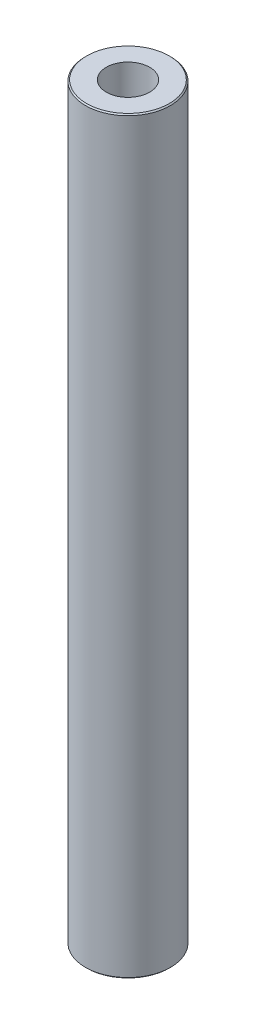
ISO-10303-21;
HEADER;
FILE_DESCRIPTION(('STEP AP214'),'2;1');
FILE_NAME('part.step','',(''),(''),'','','');
FILE_SCHEMA(('AUTOMOTIVE_DESIGN { 1 0 10303 214 1 1 1 1 }'));
ENDSEC;
DATA;
#1=APPLICATION_CONTEXT('core data for automotive mechanical design processes');
#2=APPLICATION_PROTOCOL_DEFINITION('international standard','automotive_design',2000,#1);
#3=PRODUCT_CONTEXT('',#1,'mechanical');
#4=PRODUCT('Part','Part','',(#3));
#5=PRODUCT_RELATED_PRODUCT_CATEGORY('part','',(#4));
#6=PRODUCT_DEFINITION_FORMATION('','',#4);
#7=PRODUCT_DEFINITION_CONTEXT('part definition',#1,'design');
#8=PRODUCT_DEFINITION('design','',#6,#7);
#9=PRODUCT_DEFINITION_SHAPE('','',#8);
#10=(LENGTH_UNIT() NAMED_UNIT(*) SI_UNIT(.MILLI.,.METRE.));
#11=(NAMED_UNIT(*) PLANE_ANGLE_UNIT() SI_UNIT($,.RADIAN.));
#12=(NAMED_UNIT(*) SI_UNIT($,.STERADIAN.) SOLID_ANGLE_UNIT());
#13=UNCERTAINTY_MEASURE_WITH_UNIT(LENGTH_MEASURE(1.E-05),#10,'distance_accuracy_value','');
#14=(GEOMETRIC_REPRESENTATION_CONTEXT(3) GLOBAL_UNCERTAINTY_ASSIGNED_CONTEXT((#13)) GLOBAL_UNIT_ASSIGNED_CONTEXT((#10,
#11,#12)) REPRESENTATION_CONTEXT('',''));
#15=CARTESIAN_POINT('',(0.,0.,0.));
#16=DIRECTION('',(0.,0.,1.));
#17=DIRECTION('',(1.,0.,0.));
#18=AXIS2_PLACEMENT_3D('',#15,#16,#17);
#19=CARTESIAN_POINT('',(0.,176.232016984306,0.));
#20=DIRECTION('',(0.,-1.,0.));
#21=DIRECTION('',(0.,0.,-1.));
#22=AXIS2_PLACEMENT_3D('',#19,#20,#21);
#23=CYLINDRICAL_SURFACE('',#22,10.);
#24=CARTESIAN_POINT('',(0.,175.955005369372,0.));
#25=DIRECTION('',(0.,1.,0.));
#26=DIRECTION('',(0.,0.,1.));
#27=AXIS2_PLACEMENT_3D('',#24,#25,#26);
#28=CIRCLE('',#27,10.);
#29=CARTESIAN_POINT('',(0.,175.955005369372,10.));
#30=VERTEX_POINT('',#29);
#31=EDGE_CURVE('E50',#30,#30,#28,.F.);
#32=ORIENTED_EDGE('',*,*,#31,.T.);
#33=EDGE_LOOP('',(#32));
#34=FACE_BOUND('',#33,.T.);
#35=CARTESIAN_POINT('',(0.,0.280000242436906,0.));
#36=DIRECTION('',(0.,1.,0.));
#37=DIRECTION('',(0.,0.,1.));
#38=AXIS2_PLACEMENT_3D('',#35,#36,#37);
#39=CIRCLE('',#38,10.);
#40=CARTESIAN_POINT('',(0.,0.280000242436906,10.));
#41=VERTEX_POINT('',#40);
#42=EDGE_CURVE('E51',#41,#41,#39,.T.);
#43=ORIENTED_EDGE('',*,*,#42,.T.);
#44=EDGE_LOOP('',(#43));
#45=FACE_BOUND('',#44,.T.);
#46=ADVANCED_FACE('F39',(#34,#45),#23,.T.);
#47=CARTESIAN_POINT('',(0.,176.232016984306,0.));
#48=DIRECTION('',(0.,1.,0.));
#49=DIRECTION('',(0.,0.,1.));
#50=AXIS2_PLACEMENT_3D('',#47,#48,#49);
#51=PLANE('',#50);
#52=CARTESIAN_POINT('',(0.,176.232016984306,0.));
#53=DIRECTION('',(0.,1.,0.));
#54=DIRECTION('',(0.,0.,1.));
#55=AXIS2_PLACEMENT_3D('',#52,#53,#54);
#56=CIRCLE('',#55,9.7199997575631);
#57=CARTESIAN_POINT('',(0.,176.232016984306,9.7199997575631));
#58=VERTEX_POINT('',#57);
#59=EDGE_CURVE('E54',#58,#58,#56,.T.);
#60=ORIENTED_EDGE('',*,*,#59,.T.);
#61=EDGE_LOOP('',(#60));
#62=FACE_BOUND('',#61,.T.);
#63=CARTESIAN_POINT('',(0.,176.232016984306,0.));
#64=DIRECTION('',(0.,1.,0.));
#65=DIRECTION('',(0.,0.,1.));
#66=AXIS2_PLACEMENT_3D('',#63,#64,#65);
#67=CIRCLE('',#66,5.09998180592396);
#68=CARTESIAN_POINT('',(0.,176.232016984306,5.09998180592396));
#69=VERTEX_POINT('',#68);
#70=EDGE_CURVE('E58',#69,#69,#67,.T.);
#71=ORIENTED_EDGE('',*,*,#70,.F.);
#72=EDGE_LOOP('',(#71));
#73=FACE_BOUND('',#72,.T.);
#74=ADVANCED_FACE('F69',(#62,#73),#51,.T.);
#75=CARTESIAN_POINT('',(0.,0.,0.));
#76=DIRECTION('',(0.,1.,0.));
#77=DIRECTION('',(0.,0.,1.));
#78=AXIS2_PLACEMENT_3D('',#75,#76,#77);
#79=PLANE('',#78);
#80=CARTESIAN_POINT('',(0.,0.,0.));
#81=DIRECTION('',(0.,1.,0.));
#82=DIRECTION('',(0.,0.,1.));
#83=AXIS2_PLACEMENT_3D('',#80,#81,#82);
#84=CIRCLE('',#83,9.72298838506532);
#85=CARTESIAN_POINT('',(0.,0.,9.72298838506532));
#86=VERTEX_POINT('',#85);
#87=EDGE_CURVE('E10',#86,#86,#84,.F.);
#88=ORIENTED_EDGE('',*,*,#87,.T.);
#89=EDGE_LOOP('',(#88));
#90=FACE_BOUND('',#89,.T.);
#91=CARTESIAN_POINT('',(0.,0.,0.));
#92=DIRECTION('',(0.,1.,0.));
#93=DIRECTION('',(0.,0.,1.));
#94=AXIS2_PLACEMENT_3D('',#91,#92,#93);
#95=CIRCLE('',#94,5.09998180592396);
#96=CARTESIAN_POINT('',(0.,0.,5.09998180592396));
#97=VERTEX_POINT('',#96);
#98=EDGE_CURVE('E63',#97,#97,#95,.T.);
#99=ORIENTED_EDGE('',*,*,#98,.T.);
#100=EDGE_LOOP('',(#99));
#101=FACE_BOUND('',#100,.T.);
#102=ADVANCED_FACE('F75',(#90,#101),#79,.F.);
#103=CARTESIAN_POINT('',(0.,176.232016984306,0.));
#104=DIRECTION('',(0.,-1.,0.));
#105=DIRECTION('',(0.,0.,-1.));
#106=AXIS2_PLACEMENT_3D('',#103,#104,#105);
#107=CYLINDRICAL_SURFACE('',#106,5.09998180592396);
#108=ORIENTED_EDGE('',*,*,#70,.T.);
#109=EDGE_LOOP('',(#108));
#110=FACE_BOUND('',#109,.T.);
#111=ORIENTED_EDGE('',*,*,#98,.F.);
#112=EDGE_LOOP('',(#111));
#113=FACE_BOUND('',#112,.T.);
#114=ADVANCED_FACE('F70',(#110,#113),#107,.F.);
#115=CARTESIAN_POINT('',(0.,176.232016984306,0.));
#116=DIRECTION('',(0.,-1.,0.));
#117=DIRECTION('',(0.,0.,-1.));
#118=AXIS2_PLACEMENT_3D('',#115,#116,#117);
#119=CONICAL_SURFACE('',#118,9.7199997575631,0.790763576690017);
#120=ORIENTED_EDGE('',*,*,#31,.F.);
#121=EDGE_LOOP('',(#120));
#122=FACE_BOUND('',#121,.T.);
#123=ORIENTED_EDGE('',*,*,#59,.F.);
#124=EDGE_LOOP('',(#123));
#125=FACE_BOUND('',#124,.T.);
#126=ADVANCED_FACE('F81',(#122,#125),#119,.T.);
#127=CARTESIAN_POINT('',(0.,0.280000242436906,0.));
#128=DIRECTION('',(0.,1.,0.));
#129=DIRECTION('',(0.,0.,1.));
#130=AXIS2_PLACEMENT_3D('',#127,#128,#129);
#131=CONICAL_SURFACE('',#130,10.,0.780032750104924);
#132=ORIENTED_EDGE('',*,*,#87,.F.);
#133=EDGE_LOOP('',(#132));
#134=FACE_BOUND('',#133,.T.);
#135=ORIENTED_EDGE('',*,*,#42,.F.);
#136=EDGE_LOOP('',(#135));
#137=FACE_BOUND('',#136,.T.);
#138=ADVANCED_FACE('F45',(#134,#137),#131,.T.);
#139=CLOSED_SHELL('',(#46,#74,#102,#114,#126,#138));
#140=MANIFOLD_SOLID_BREP('B2',#139);
#141=ADVANCED_BREP_SHAPE_REPRESENTATION('',(#18,#140),#14);
#142=SHAPE_DEFINITION_REPRESENTATION(#9,#141);
ENDSEC;
END-ISO-10303-21;
